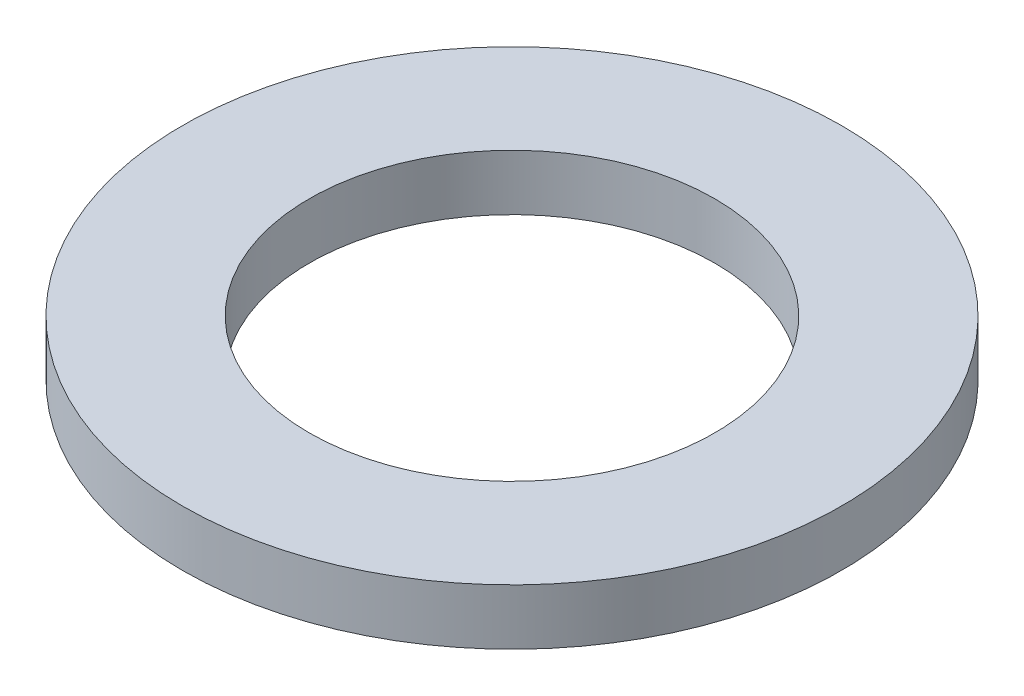
ISO-10303-21;
HEADER;
FILE_DESCRIPTION(('STEP AP214'),'2;1');
FILE_NAME('part.step','',(''),(''),'','','');
FILE_SCHEMA(('AUTOMOTIVE_DESIGN { 1 0 10303 214 1 1 1 1 }'));
ENDSEC;
DATA;
#1=APPLICATION_CONTEXT('core data for automotive mechanical design processes');
#2=APPLICATION_PROTOCOL_DEFINITION('international standard','automotive_design',2000,#1);
#3=PRODUCT_CONTEXT('',#1,'mechanical');
#4=PRODUCT('Part','Part','',(#3));
#5=PRODUCT_RELATED_PRODUCT_CATEGORY('part','',(#4));
#6=PRODUCT_DEFINITION_FORMATION('','',#4);
#7=PRODUCT_DEFINITION_CONTEXT('part definition',#1,'design');
#8=PRODUCT_DEFINITION('design','',#6,#7);
#9=PRODUCT_DEFINITION_SHAPE('','',#8);
#10=(LENGTH_UNIT() NAMED_UNIT(*) SI_UNIT(.MILLI.,.METRE.));
#11=(NAMED_UNIT(*) PLANE_ANGLE_UNIT() SI_UNIT($,.RADIAN.));
#12=(NAMED_UNIT(*) SI_UNIT($,.STERADIAN.) SOLID_ANGLE_UNIT());
#13=UNCERTAINTY_MEASURE_WITH_UNIT(LENGTH_MEASURE(1.E-05),#10,'distance_accuracy_value','');
#14=(GEOMETRIC_REPRESENTATION_CONTEXT(3) GLOBAL_UNCERTAINTY_ASSIGNED_CONTEXT((#13)) GLOBAL_UNIT_ASSIGNED_CONTEXT((#10,
#11,#12)) REPRESENTATION_CONTEXT('',''));
#15=CARTESIAN_POINT('',(0.,0.,0.));
#16=DIRECTION('',(0.,0.,1.));
#17=DIRECTION('',(1.,0.,0.));
#18=AXIS2_PLACEMENT_3D('',#15,#16,#17);
#19=CARTESIAN_POINT('',(0.,11.,0.));
#20=DIRECTION('',(0.,-1.,0.));
#21=DIRECTION('',(0.,0.,-1.));
#22=AXIS2_PLACEMENT_3D('',#19,#20,#21);
#23=CYLINDRICAL_SURFACE('',#22,65.);
#24=CARTESIAN_POINT('',(0.,11.,0.));
#25=DIRECTION('',(0.,1.,0.));
#26=DIRECTION('',(0.,0.,1.));
#27=AXIS2_PLACEMENT_3D('',#24,#25,#26);
#28=CIRCLE('',#27,65.);
#29=CARTESIAN_POINT('',(0.,11.,65.));
#30=VERTEX_POINT('',#29);
#31=EDGE_CURVE('E10',#30,#30,#28,.T.);
#32=ORIENTED_EDGE('',*,*,#31,.F.);
#33=EDGE_LOOP('',(#32));
#34=FACE_BOUND('',#33,.T.);
#35=CARTESIAN_POINT('',(0.,0.,0.));
#36=DIRECTION('',(0.,1.,0.));
#37=DIRECTION('',(0.,0.,1.));
#38=AXIS2_PLACEMENT_3D('',#35,#36,#37);
#39=CIRCLE('',#38,65.);
#40=CARTESIAN_POINT('',(0.,0.,65.));
#41=VERTEX_POINT('',#40);
#42=EDGE_CURVE('E37',#41,#41,#39,.T.);
#43=ORIENTED_EDGE('',*,*,#42,.T.);
#44=EDGE_LOOP('',(#43));
#45=FACE_BOUND('',#44,.T.);
#46=ADVANCED_FACE('F40',(#34,#45),#23,.T.);
#47=CARTESIAN_POINT('',(0.,11.,0.));
#48=DIRECTION('',(0.,1.,0.));
#49=DIRECTION('',(0.,0.,1.));
#50=AXIS2_PLACEMENT_3D('',#47,#48,#49);
#51=PLANE('',#50);
#52=CARTESIAN_POINT('',(0.,11.,0.));
#53=DIRECTION('',(0.,1.,0.));
#54=DIRECTION('',(0.,0.,1.));
#55=AXIS2_PLACEMENT_3D('',#52,#53,#54);
#56=CIRCLE('',#55,40.);
#57=CARTESIAN_POINT('',(0.,11.,40.));
#58=VERTEX_POINT('',#57);
#59=EDGE_CURVE('E50',#58,#58,#56,.T.);
#60=ORIENTED_EDGE('',*,*,#59,.F.);
#61=EDGE_LOOP('',(#60));
#62=FACE_BOUND('',#61,.T.);
#63=ORIENTED_EDGE('',*,*,#31,.T.);
#64=EDGE_LOOP('',(#63));
#65=FACE_BOUND('',#64,.T.);
#66=ADVANCED_FACE('F59',(#62,#65),#51,.T.);
#67=CARTESIAN_POINT('',(0.,0.,0.));
#68=DIRECTION('',(0.,1.,0.));
#69=DIRECTION('',(0.,0.,1.));
#70=AXIS2_PLACEMENT_3D('',#67,#68,#69);
#71=PLANE('',#70);
#72=CARTESIAN_POINT('',(0.,0.,0.));
#73=DIRECTION('',(0.,1.,0.));
#74=DIRECTION('',(0.,0.,1.));
#75=AXIS2_PLACEMENT_3D('',#72,#73,#74);
#76=CIRCLE('',#75,40.);
#77=CARTESIAN_POINT('',(0.,0.,40.));
#78=VERTEX_POINT('',#77);
#79=EDGE_CURVE('E47',#78,#78,#76,.T.);
#80=ORIENTED_EDGE('',*,*,#79,.T.);
#81=EDGE_LOOP('',(#80));
#82=FACE_BOUND('',#81,.T.);
#83=ORIENTED_EDGE('',*,*,#42,.F.);
#84=EDGE_LOOP('',(#83));
#85=FACE_BOUND('',#84,.T.);
#86=ADVANCED_FACE('F58',(#82,#85),#71,.F.);
#87=CARTESIAN_POINT('',(0.,11.,0.));
#88=DIRECTION('',(0.,-1.,0.));
#89=DIRECTION('',(0.,0.,-1.));
#90=AXIS2_PLACEMENT_3D('',#87,#88,#89);
#91=CYLINDRICAL_SURFACE('',#90,40.);
#92=ORIENTED_EDGE('',*,*,#59,.T.);
#93=EDGE_LOOP('',(#92));
#94=FACE_BOUND('',#93,.T.);
#95=ORIENTED_EDGE('',*,*,#79,.F.);
#96=EDGE_LOOP('',(#95));
#97=FACE_BOUND('',#96,.T.);
#98=ADVANCED_FACE('F54',(#94,#97),#91,.F.);
#99=CLOSED_SHELL('',(#46,#66,#86,#98));
#100=MANIFOLD_SOLID_BREP('B2',#99);
#101=ADVANCED_BREP_SHAPE_REPRESENTATION('',(#18,#100),#14);
#102=SHAPE_DEFINITION_REPRESENTATION(#9,#101);
ENDSEC;
END-ISO-10303-21;
